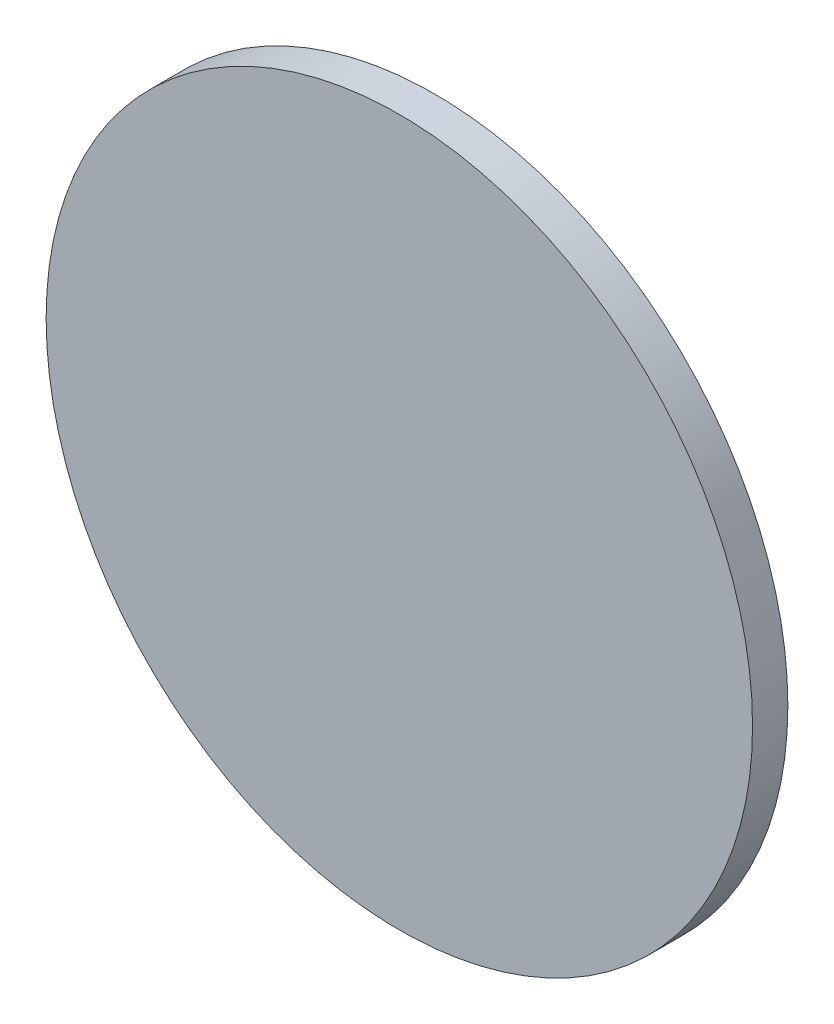
ISO-10303-21;
HEADER;
FILE_DESCRIPTION(('STEP AP214'),'2;1');
FILE_NAME('part.step','',(''),(''),'','','');
FILE_SCHEMA(('AUTOMOTIVE_DESIGN { 1 0 10303 214 1 1 1 1 }'));
ENDSEC;
DATA;
#1=APPLICATION_CONTEXT('core data for automotive mechanical design processes');
#2=APPLICATION_PROTOCOL_DEFINITION('international standard','automotive_design',2000,#1);
#3=PRODUCT_CONTEXT('',#1,'mechanical');
#4=PRODUCT('Part','Part','',(#3));
#5=PRODUCT_RELATED_PRODUCT_CATEGORY('part','',(#4));
#6=PRODUCT_DEFINITION_FORMATION('','',#4);
#7=PRODUCT_DEFINITION_CONTEXT('part definition',#1,'design');
#8=PRODUCT_DEFINITION('design','',#6,#7);
#9=PRODUCT_DEFINITION_SHAPE('','',#8);
#10=(LENGTH_UNIT() NAMED_UNIT(*) SI_UNIT(.MILLI.,.METRE.));
#11=(NAMED_UNIT(*) PLANE_ANGLE_UNIT() SI_UNIT($,.RADIAN.));
#12=(NAMED_UNIT(*) SI_UNIT($,.STERADIAN.) SOLID_ANGLE_UNIT());
#13=UNCERTAINTY_MEASURE_WITH_UNIT(LENGTH_MEASURE(1.E-05),#10,'distance_accuracy_value','');
#14=(GEOMETRIC_REPRESENTATION_CONTEXT(3) GLOBAL_UNCERTAINTY_ASSIGNED_CONTEXT((#13)) GLOBAL_UNIT_ASSIGNED_CONTEXT((#10,
#11,#12)) REPRESENTATION_CONTEXT('',''));
#15=CARTESIAN_POINT('',(0.,0.,0.));
#16=DIRECTION('',(0.,0.,1.));
#17=DIRECTION('',(1.,0.,0.));
#18=AXIS2_PLACEMENT_3D('',#15,#16,#17);
#19=CARTESIAN_POINT('',(0.,0.,10.));
#20=DIRECTION('',(0.,0.,-1.));
#21=DIRECTION('',(-1.,0.,0.));
#22=AXIS2_PLACEMENT_3D('',#19,#20,#21);
#23=CYLINDRICAL_SURFACE('',#22,100.);
#24=CARTESIAN_POINT('',(0.,0.,10.));
#25=DIRECTION('',(0.,0.,1.));
#26=DIRECTION('',(1.,0.,0.));
#27=AXIS2_PLACEMENT_3D('',#24,#25,#26);
#28=CIRCLE('',#27,100.);
#29=CARTESIAN_POINT('',(100.,0.,10.));
#30=VERTEX_POINT('',#29);
#31=EDGE_CURVE('E10',#30,#30,#28,.T.);
#32=ORIENTED_EDGE('',*,*,#31,.F.);
#33=EDGE_LOOP('',(#32));
#34=FACE_BOUND('',#33,.T.);
#35=CARTESIAN_POINT('',(0.,0.,0.));
#36=DIRECTION('',(0.,0.,1.));
#37=DIRECTION('',(1.,0.,0.));
#38=AXIS2_PLACEMENT_3D('',#35,#36,#37);
#39=CIRCLE('',#38,100.);
#40=CARTESIAN_POINT('',(100.,0.,0.));
#41=VERTEX_POINT('',#40);
#42=EDGE_CURVE('E34',#41,#41,#39,.T.);
#43=ORIENTED_EDGE('',*,*,#42,.T.);
#44=EDGE_LOOP('',(#43));
#45=FACE_BOUND('',#44,.T.);
#46=ADVANCED_FACE('F31',(#34,#45),#23,.T.);
#47=CARTESIAN_POINT('',(0.,0.,10.));
#48=DIRECTION('',(0.,0.,1.));
#49=DIRECTION('',(1.,0.,0.));
#50=AXIS2_PLACEMENT_3D('',#47,#48,#49);
#51=PLANE('',#50);
#52=ORIENTED_EDGE('',*,*,#31,.T.);
#53=EDGE_LOOP('',(#52));
#54=FACE_BOUND('',#53,.T.);
#55=ADVANCED_FACE('F46',(#54),#51,.T.);
#56=CARTESIAN_POINT('',(0.,0.,0.));
#57=DIRECTION('',(0.,0.,1.));
#58=DIRECTION('',(1.,0.,0.));
#59=AXIS2_PLACEMENT_3D('',#56,#57,#58);
#60=PLANE('',#59);
#61=ORIENTED_EDGE('',*,*,#42,.F.);
#62=EDGE_LOOP('',(#61));
#63=FACE_BOUND('',#62,.T.);
#64=ADVANCED_FACE('F44',(#63),#60,.F.);
#65=CLOSED_SHELL('',(#46,#55,#64));
#66=MANIFOLD_SOLID_BREP('B2',#65);
#67=ADVANCED_BREP_SHAPE_REPRESENTATION('',(#18,#66),#14);
#68=SHAPE_DEFINITION_REPRESENTATION(#9,#67);
ENDSEC;
END-ISO-10303-21;
